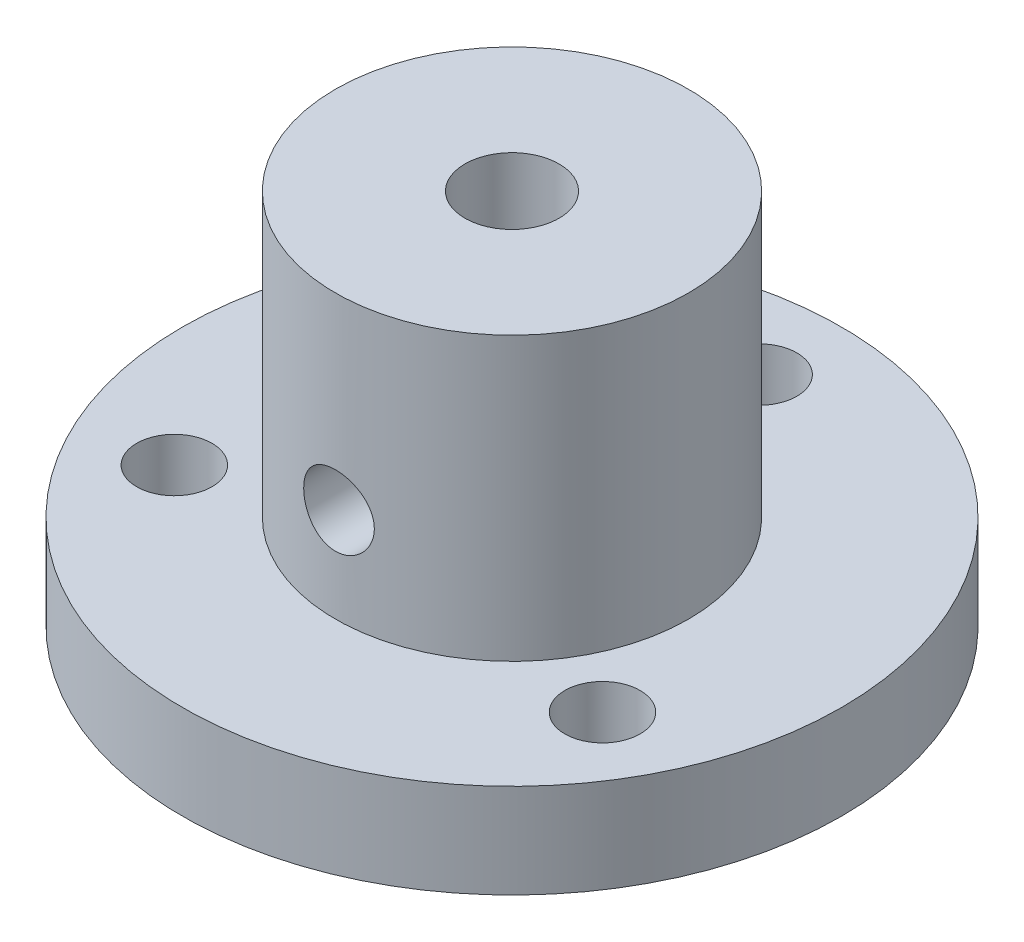
ISO-10303-21;
HEADER;
FILE_DESCRIPTION(('STEP AP214'),'2;1');
FILE_NAME('part.step','',(''),(''),'','','');
FILE_SCHEMA(('AUTOMOTIVE_DESIGN { 1 0 10303 214 1 1 1 1 }'));
ENDSEC;
DATA;
#1=APPLICATION_CONTEXT('core data for automotive mechanical design processes');
#2=APPLICATION_PROTOCOL_DEFINITION('international standard','automotive_design',2000,#1);
#3=PRODUCT_CONTEXT('',#1,'mechanical');
#4=PRODUCT('Part','Part','',(#3));
#5=PRODUCT_RELATED_PRODUCT_CATEGORY('part','',(#4));
#6=PRODUCT_DEFINITION_FORMATION('','',#4);
#7=PRODUCT_DEFINITION_CONTEXT('part definition',#1,'design');
#8=PRODUCT_DEFINITION('design','',#6,#7);
#9=PRODUCT_DEFINITION_SHAPE('','',#8);
#10=(LENGTH_UNIT() NAMED_UNIT(*) SI_UNIT(.MILLI.,.METRE.));
#11=(NAMED_UNIT(*) PLANE_ANGLE_UNIT() SI_UNIT($,.RADIAN.));
#12=(NAMED_UNIT(*) SI_UNIT($,.STERADIAN.) SOLID_ANGLE_UNIT());
#13=UNCERTAINTY_MEASURE_WITH_UNIT(LENGTH_MEASURE(1.E-05),#10,'distance_accuracy_value','');
#14=(GEOMETRIC_REPRESENTATION_CONTEXT(3) GLOBAL_UNCERTAINTY_ASSIGNED_CONTEXT((#13)) GLOBAL_UNIT_ASSIGNED_CONTEXT((#10,
#11,#12)) REPRESENTATION_CONTEXT('',''));
#15=CARTESIAN_POINT('',(0.,0.,0.));
#16=DIRECTION('',(0.,0.,1.));
#17=DIRECTION('',(1.,0.,0.));
#18=AXIS2_PLACEMENT_3D('',#15,#16,#17);
#19=CARTESIAN_POINT('',(0.,0.,0.));
#20=DIRECTION('',(0.,1.,0.));
#21=DIRECTION('',(-1.,0.,0.));
#22=AXIS2_PLACEMENT_3D('',#19,#20,#21);
#23=CYLINDRICAL_SURFACE('',#22,7.5);
#24=CARTESIAN_POINT('',(0.,16.,0.));
#25=DIRECTION('',(0.,1.,0.));
#26=DIRECTION('',(-1.,0.,0.));
#27=AXIS2_PLACEMENT_3D('',#24,#25,#26);
#28=CIRCLE('',#27,7.5);
#29=CARTESIAN_POINT('',(-7.5,16.,0.));
#30=VERTEX_POINT('',#29);
#31=EDGE_CURVE('E82',#30,#30,#28,.T.);
#32=ORIENTED_EDGE('',*,*,#31,.F.);
#33=EDGE_LOOP('',(#32));
#34=FACE_BOUND('',#33,.T.);
#35=CARTESIAN_POINT('',(0.,4.,0.));
#36=DIRECTION('',(0.,1.,0.));
#37=DIRECTION('',(-1.,0.,0.));
#38=AXIS2_PLACEMENT_3D('',#35,#36,#37);
#39=CIRCLE('',#38,7.5);
#40=CARTESIAN_POINT('',(-7.5,4.,0.));
#41=VERTEX_POINT('',#40);
#42=EDGE_CURVE('E56',#41,#41,#39,.T.);
#43=ORIENTED_EDGE('',*,*,#42,.T.);
#44=EDGE_LOOP('',(#43));
#45=FACE_BOUND('',#44,.T.);
#46=CARTESIAN_POINT('',(-1.5,8.,7.34846922834953));
#47=CARTESIAN_POINT('',(-1.49999691881235,8.08334656323576,7.34847088538349));
#48=CARTESIAN_POINT('',(-1.49302975757707,8.16673193499975,7.34990262402618));
#49=CARTESIAN_POINT('',(-1.46536842537441,8.33114375771496,7.35546646957747));
#50=CARTESIAN_POINT('',(-1.44466327060578,8.41216826695404,7.35960073717297));
#51=CARTESIAN_POINT('',(-1.39019367392958,8.56945595503125,7.37008310582665));
#52=CARTESIAN_POINT('',(-1.35644222122892,8.64572378229887,7.37642900431582));
#53=CARTESIAN_POINT('',(-1.27687366150577,8.79151226704545,7.39061699221019));
#54=CARTESIAN_POINT('',(-1.23105722790173,8.86103330080686,7.398458998102));
#55=CARTESIAN_POINT('',(-1.12796861348015,8.99234150578079,7.4148794954137));
#56=CARTESIAN_POINT('',(-1.07055848386998,9.05401938182596,7.42346606755867));
#57=CARTESIAN_POINT('',(-0.946210183531966,9.16693630036847,7.440337084539));
#58=CARTESIAN_POINT('',(-0.879271345466976,9.21817461112579,7.44862150816248));
#59=CARTESIAN_POINT('',(-0.737042033886383,9.30918202644269,7.46404194626342));
#60=CARTESIAN_POINT('',(-0.661683851508316,9.34884727072496,7.47116732162326));
#61=CARTESIAN_POINT('',(-0.505206225580908,9.4149124055722,7.48337605325447));
#62=CARTESIAN_POINT('',(-0.42408732213083,9.44131353785149,7.48845960066179));
#63=CARTESIAN_POINT('',(-0.259525159917742,9.47976079042944,7.49595481032627));
#64=CARTESIAN_POINT('',(-0.176126608822222,9.49199146635651,7.4984007943219));
#65=CARTESIAN_POINT('',(-0.00842785265630505,9.50232642775747,7.50046381775405));
#66=CARTESIAN_POINT('',(0.0758722647477642,9.50043207446873,7.50008112979138));
#67=CARTESIAN_POINT('',(0.241713001115382,9.48271072967667,7.49655652302773));
#68=CARTESIAN_POINT('',(0.323275821447705,9.46708253424823,7.49345397548757));
#69=CARTESIAN_POINT('',(0.482597439870451,9.42265245131166,7.48488265739113));
#70=CARTESIAN_POINT('',(0.560356085620693,9.39385003671219,7.47941379216058));
#71=CARTESIAN_POINT('',(0.71042919480133,9.3237049397791,7.46665944029938));
#72=CARTESIAN_POINT('',(0.782706261200849,9.28228437334267,7.45936272262835));
#73=CARTESIAN_POINT('',(0.919357568789633,9.1881363841451,7.44375704210678));
#74=CARTESIAN_POINT('',(0.9837308992875,9.13540766034423,7.43544796282833));
#75=CARTESIAN_POINT('',(1.10392714658019,9.01904956683729,7.41856446546689));
#76=CARTESIAN_POINT('',(1.15958147486045,8.95524621990562,7.40998794686274));
#77=CARTESIAN_POINT('',(1.25942773976521,8.81912533632387,7.39367357398141));
#78=CARTESIAN_POINT('',(1.30361945959163,8.74680763867521,7.38593573556822));
#79=CARTESIAN_POINT('',(1.37934422220282,8.59546875226729,7.37217071209385));
#80=CARTESIAN_POINT('',(1.41084997166656,8.51643354854051,7.36614722345324));
#81=CARTESIAN_POINT('',(1.46008551244137,8.35404301441401,7.35654714481909));
#82=CARTESIAN_POINT('',(1.47781709918496,8.27068824857137,7.35297023592641));
#83=CARTESIAN_POINT('',(1.49874900905408,8.10355271300143,7.34873218901741));
#84=CARTESIAN_POINT('',(1.50219278834687,8.01980363853449,7.34802220585731));
#85=CARTESIAN_POINT('',(1.49510644246611,7.85292766520047,7.34946728533281));
#86=CARTESIAN_POINT('',(1.48457710968366,7.7698007313217,7.35162218550582));
#87=CARTESIAN_POINT('',(1.45005331211124,7.60734703956165,7.35850848742372));
#88=CARTESIAN_POINT('',(1.42618893125895,7.52799148544635,7.36321498521745));
#89=CARTESIAN_POINT('',(1.36581155296278,7.37440508145689,7.37465234027497));
#90=CARTESIAN_POINT('',(1.32929751355976,7.30017465434642,7.38138336429404));
#91=CARTESIAN_POINT('',(1.2441062133234,7.15788033507476,7.39622108943059));
#92=CARTESIAN_POINT('',(1.19527661697413,7.08990943054876,7.40434457797355));
#93=CARTESIAN_POINT('',(1.08704335831907,6.96303753199863,7.42100585739955));
#94=CARTESIAN_POINT('',(1.02763860771681,6.90413747262612,7.42954369085727));
#95=CARTESIAN_POINT('',(0.898848410246835,6.79615616122163,7.44623018803823));
#96=CARTESIAN_POINT('',(0.829323748394444,6.74723951802501,7.45437086563026));
#97=CARTESIAN_POINT('',(0.682901844952132,6.66178117775062,7.4692069144293));
#98=CARTESIAN_POINT('',(0.606004913150259,6.62523896098283,7.47590234632816));
#99=CARTESIAN_POINT('',(0.447454021236018,6.56580669238005,7.487059410916));
#100=CARTESIAN_POINT('',(0.365830010217116,6.54283922266062,7.49153368713906));
#101=CARTESIAN_POINT('',(0.199784182019868,6.51096312850423,7.4977985390649));
#102=CARTESIAN_POINT('',(0.115362703066821,6.50205281078648,7.49958943799765));
#103=CARTESIAN_POINT('',(-0.0523093408554355,6.49860952855567,7.50027810681181));
#104=CARTESIAN_POINT('',(-0.135554718212254,6.50382907931568,7.49922567824026));
#105=CARTESIAN_POINT('',(-0.299956546973463,6.52795092582172,7.49445065340477));
#106=CARTESIAN_POINT('',(-0.381113024630537,6.54685304952211,7.49072809071528));
#107=CARTESIAN_POINT('',(-0.538879124617644,6.59769348813747,7.481032475475));
#108=CARTESIAN_POINT('',(-0.615498664860421,6.62960206719678,7.47506455871865));
#109=CARTESIAN_POINT('',(-0.762331830278929,6.70551836199635,7.46152083185077));
#110=CARTESIAN_POINT('',(-0.832544948651118,6.74952703385557,7.45394489468828));
#111=CARTESIAN_POINT('',(-0.965795835159536,6.84922908059312,7.43786398736791));
#112=CARTESIAN_POINT('',(-1.02869957417475,6.90509950458016,7.4293460013317));
#113=CARTESIAN_POINT('',(-1.14432392663527,7.02657536014365,7.41241834355477));
#114=CARTESIAN_POINT('',(-1.19704212480408,7.09218309420307,7.40400869794476));
#115=CARTESIAN_POINT('',(-1.29133832918279,7.23211897505031,7.3881501412478));
#116=CARTESIAN_POINT('',(-1.33279022195961,7.30653344174069,7.38071255446371));
#117=CARTESIAN_POINT('',(-1.40253607393175,7.4613991599494,7.36777855777287));
#118=CARTESIAN_POINT('',(-1.43084196896908,7.54184485804634,7.36228038807748));
#119=CARTESIAN_POINT('',(-1.4680037097813,7.68539368315525,7.3549452169166));
#120=CARTESIAN_POINT('',(-1.47998084778413,7.74767812926849,7.35253177367824));
#121=CARTESIAN_POINT('',(-1.49598002694097,7.87330093182915,7.34929317692711));
#122=CARTESIAN_POINT('',(-1.50000234234439,7.93663925186744,7.34846796865858));
#123=CARTESIAN_POINT('',(-1.5,8.,7.34846922834953));
#124=B_SPLINE_CURVE_WITH_KNOTS('',3,(#46,#47,#48,#49,#50,#51,#52,#53,#54,#55,#56,#57,#58,#59,
#60,#61,#62,#63,#64,#65,#66,#67,#68,#69,#70,#71,#72,#73,#74,#75,#76,#77,#78,#79,#80,#81,#82,#83,
#84,#85,#86,#87,#88,#89,#90,#91,#92,#93,#94,#95,#96,#97,#98,#99,#100,#101,#102,#103,#104,#105,
#106,#107,#108,#109,#110,#111,#112,#113,#114,#115,#116,#117,#118,#119,#120,#121,#122,#123),
.UNSPECIFIED.,.T.,.F.,(4,2,2,2,2,2,2,2,2,2,2,2,2,2,2,2,2,2,2,2,2,2,2,2,2,2,2,2,2,2,2,2,2,2,2,2,
2,2,4),(0.,0.249807695804143,0.499815358926445,0.74957474691088,0.999320197289796,
1.25223378822655,1.50516510053133,1.76030100656175,2.0154130236984,2.26716373324621,
2.51889018174372,2.76703184450306,3.01518343610625,3.26489886333455,3.51464303655099,
3.76874020143725,4.02284217184081,4.27748794759165,4.53210052524037,4.78235636706891,
5.03259801792632,5.28044012674978,5.52830265531598,5.77939589661781,6.03051499305313,
6.28548902600176,6.54045234945157,6.79394720367975,7.04741152037442,7.29646526122029,
7.54551587050135,7.79400025613177,8.04250428202026,8.29501728038395,8.54759008334671,
8.80288347868562,9.05794462633399,9.24785705455344,9.43776293526322),.UNSPECIFIED.);
#125=CARTESIAN_POINT('',(-1.5,8.,7.34846922834953));
#126=VERTEX_POINT('',#125);
#127=EDGE_CURVE('E123',#126,#126,#124,.T.);
#128=ORIENTED_EDGE('',*,*,#127,.T.);
#129=EDGE_LOOP('',(#128));
#130=FACE_BOUND('',#129,.T.);
#131=ADVANCED_FACE('F36',(#34,#45,#130),#23,.T.);
#132=CARTESIAN_POINT('',(0.,0.,0.));
#133=DIRECTION('',(0.,1.,0.));
#134=DIRECTION('',(-1.,0.,0.));
#135=AXIS2_PLACEMENT_3D('',#132,#133,#134);
#136=CYLINDRICAL_SURFACE('',#135,2.);
#137=CARTESIAN_POINT('',(0.,0.,0.));
#138=DIRECTION('',(0.,1.,0.));
#139=DIRECTION('',(-1.,0.,0.));
#140=AXIS2_PLACEMENT_3D('',#137,#138,#139);
#141=CIRCLE('',#140,2.);
#142=CARTESIAN_POINT('',(-2.,0.,0.));
#143=VERTEX_POINT('',#142);
#144=EDGE_CURVE('E71',#143,#143,#141,.T.);
#145=ORIENTED_EDGE('',*,*,#144,.F.);
#146=EDGE_LOOP('',(#145));
#147=FACE_BOUND('',#146,.T.);
#148=CARTESIAN_POINT('',(0.,16.,0.));
#149=DIRECTION('',(0.,1.,0.));
#150=DIRECTION('',(-1.,0.,0.));
#151=AXIS2_PLACEMENT_3D('',#148,#149,#150);
#152=CIRCLE('',#151,2.);
#153=CARTESIAN_POINT('',(-2.,16.,0.));
#154=VERTEX_POINT('',#153);
#155=EDGE_CURVE('E76',#154,#154,#152,.T.);
#156=ORIENTED_EDGE('',*,*,#155,.T.);
#157=EDGE_LOOP('',(#156));
#158=FACE_BOUND('',#157,.T.);
#159=CARTESIAN_POINT('',(-1.5,8.,1.3228756555323));
#160=CARTESIAN_POINT('',(-1.49999219049447,7.93000257657437,1.32289190044095));
#161=CARTESIAN_POINT('',(-1.4950410907442,7.85995416568808,1.32856366615417));
#162=CARTESIAN_POINT('',(-1.47578333210409,7.72267014379052,1.34990644032802));
#163=CARTESIAN_POINT('',(-1.46144878565587,7.65544355498049,1.3656072516867));
#164=CARTESIAN_POINT('',(-1.42483838991846,7.52642015326162,1.40375127916871));
#165=CARTESIAN_POINT('',(-1.40267483444956,7.46456122323754,1.42609848244814));
#166=CARTESIAN_POINT('',(-1.35130655299363,7.34565454555481,1.47486455031267));
#167=CARTESIAN_POINT('',(-1.3221026780169,7.28860621753078,1.50128292264932));
#168=CARTESIAN_POINT('',(-1.25039909811054,7.16788720368341,1.56177312961147));
#169=CARTESIAN_POINT('',(-1.20639573950363,7.10533206577352,1.59628904009787));
#170=CARTESIAN_POINT('',(-1.10933596759308,6.98747453375773,1.66521164096378));
#171=CARTESIAN_POINT('',(-1.05626622282799,6.93218303517973,1.69961809339876));
#172=CARTESIAN_POINT('',(-0.929610192252514,6.81914126134453,1.77262582436251));
#173=CARTESIAN_POINT('',(-0.854047289142163,6.76319403328014,1.81064921229759));
#174=CARTESIAN_POINT('',(-0.69118971482194,6.66537779171716,1.87882809751632));
#175=CARTESIAN_POINT('',(-0.603923293836167,6.62347570253119,1.90900204180106));
#176=CARTESIAN_POINT('',(-0.447869023983645,6.56679231409706,1.95034258990248));
#177=CARTESIAN_POINT('',(-0.381446049692536,6.54764290402153,1.96449710921006));
#178=CARTESIAN_POINT('',(-0.245552609316542,6.51860988400325,1.98605635937555));
#179=CARTESIAN_POINT('',(-0.17608484599517,6.50871822389326,1.99346695432364));
#180=CARTESIAN_POINT('',(-0.0358650926220279,6.49877826613751,2.00091375578087));
#181=CARTESIAN_POINT('',(0.0348897591186388,6.49875554562356,2.00093080057495));
#182=CARTESIAN_POINT('',(0.175316156674036,6.50861793678029,1.99354206503066));
#183=CARTESIAN_POINT('',(0.244987447822227,6.51850534290814,1.98613456571337));
#184=CARTESIAN_POINT('',(0.378889193792651,6.54708105058987,1.96491377944411));
#185=CARTESIAN_POINT('',(0.443224268236295,6.56545632638707,1.9513285776568));
#186=CARTESIAN_POINT('',(0.567680485046396,6.60999564218224,1.91882278657017));
#187=CARTESIAN_POINT('',(0.627800705033635,6.63616138051316,1.89990103394193));
#188=CARTESIAN_POINT('',(0.749216921864729,6.69852961514531,1.85561045984504));
#189=CARTESIAN_POINT('',(0.809935384713597,6.73551209661876,1.82976540608097));
#190=CARTESIAN_POINT('',(0.924567250548283,6.81673370397051,1.77460702483739));
#191=CARTESIAN_POINT('',(0.97847478462122,6.8609790136999,1.74529074780453));
#192=CARTESIAN_POINT('',(1.08908204283329,6.96522334882094,1.6789376587236));
#193=CARTESIAN_POINT('',(1.14424493004784,7.0266092100264,1.64151655866368));
#194=CARTESIAN_POINT('',(1.24400875556228,7.15783458362194,1.56725958283769));
#195=CARTESIAN_POINT('',(1.28860466211477,7.22767809952506,1.53042399363523));
#196=CARTESIAN_POINT('',(1.358732064116,7.36098187024563,1.46819425999159));
#197=CARTESIAN_POINT('',(1.38628866868102,7.42298704530065,1.44197599789983));
#198=CARTESIAN_POINT('',(1.43319397108784,7.55206528141938,1.39536741257394));
#199=CARTESIAN_POINT('',(1.45256121808259,7.61912647969037,1.37496395320511));
#200=CARTESIAN_POINT('',(1.47902385350669,7.74368694399832,1.34640050620232));
#201=CARTESIAN_POINT('',(1.48779069496582,7.80044708211686,1.3366153955687));
#202=CARTESIAN_POINT('',(1.49871760619789,7.91535546617383,1.32435588438334));
#203=CARTESIAN_POINT('',(1.50088612873265,7.97350183990282,1.32187213058307));
#204=CARTESIAN_POINT('',(1.49845270115552,8.08947899173339,1.32462868790497));
#205=CARTESIAN_POINT('',(1.4938482589949,8.14730964580967,1.32987184207164));
#206=CARTESIAN_POINT('',(1.47822527271969,8.26107615244287,1.34721218775046));
#207=CARTESIAN_POINT('',(1.46719578056394,8.3170085979481,1.35932107727345));
#208=CARTESIAN_POINT('',(1.43413959562387,8.44633804493887,1.39427758287802));
#209=CARTESIAN_POINT('',(1.40954189769242,8.51843595391503,1.41944823697315));
#210=CARTESIAN_POINT('',(1.35088877838435,8.65630766364011,1.47537861079975));
#211=CARTESIAN_POINT('',(1.31681594335477,8.72206951729474,1.5061485847723));
#212=CARTESIAN_POINT('',(1.23869774116696,8.84934900804812,1.57108282375649));
#213=CARTESIAN_POINT('',(1.19434110060342,8.91063287621825,1.60532883846045));
#214=CARTESIAN_POINT('',(1.09682562914593,9.02600209636124,1.67347506272361));
#215=CARTESIAN_POINT('',(1.04366252194464,9.08008392798893,1.70737509574665));
#216=CARTESIAN_POINT('',(0.916234513829626,9.19127699162936,1.77960222623532));
#217=CARTESIAN_POINT('',(0.839896270946862,9.24647523885759,1.81728174165356));
#218=CARTESIAN_POINT('',(0.675551612651274,9.34262073345087,1.88453104769825));
#219=CARTESIAN_POINT('',(0.587571029974858,9.38359882458129,1.91411836052283));
#220=CARTESIAN_POINT('',(0.430755661496918,9.43843799144686,1.95419406402379));
#221=CARTESIAN_POINT('',(0.364250057327479,9.45675679327544,1.96775478029639));
#222=CARTESIAN_POINT('',(0.228364464964359,9.48412879630752,1.98810265589123));
#223=CARTESIAN_POINT('',(0.15898710456195,9.49319028154851,1.9948958710696));
#224=CARTESIAN_POINT('',(0.019147605940406,9.5015163909286,2.00113566717062));
#225=CARTESIAN_POINT('',(-0.0513166925870804,9.50075801734825,2.00056500218907));
#226=CARTESIAN_POINT('',(-0.191009011030074,9.48943900869876,1.9920880324381));
#227=CARTESIAN_POINT('',(-0.260236696591282,9.47887576229252,1.98417977344351));
#228=CARTESIAN_POINT('',(-0.393521935254966,9.44902508383276,1.96203400925195));
#229=CARTESIAN_POINT('',(-0.457671236511436,9.42999981867845,1.94798690792879));
#230=CARTESIAN_POINT('',(-0.581661343097383,9.38421193438106,1.91462720575136));
#231=CARTESIAN_POINT('',(-0.641501223388809,9.35744766016909,1.89531347862387));
#232=CARTESIAN_POINT('',(-0.762547698766807,9.29372206240404,1.85017642210641));
#233=CARTESIAN_POINT('',(-0.823141236713413,9.25594906864042,1.82386352707581));
#234=CARTESIAN_POINT('',(-0.937414811724209,9.17313355944579,1.76785506075717));
#235=CARTESIAN_POINT('',(-0.991088412383368,9.12808436271396,1.73815638795658));
#236=CARTESIAN_POINT('',(-1.10112380660681,9.02199463343921,1.67106353042107));
#237=CARTESIAN_POINT('',(-1.15591691541995,8.9595536005601,1.63330922504698));
#238=CARTESIAN_POINT('',(-1.2547525342935,8.82613192810013,1.55866082463333));
#239=CARTESIAN_POINT('',(-1.29879110556728,8.75514817396344,1.52176704921892));
#240=CARTESIAN_POINT('',(-1.36695971301454,8.6211167494097,1.46049601449285));
#241=CARTESIAN_POINT('',(-1.39333526337998,8.55966501729345,1.43513625007637));
#242=CARTESIAN_POINT('',(-1.43805398028599,8.43191708694413,1.39032564651233));
#243=CARTESIAN_POINT('',(-1.45641847678344,8.36563430840455,1.37085915899696));
#244=CARTESIAN_POINT('',(-1.4799705775638,8.24921178040307,1.34532423383262));
#245=CARTESIAN_POINT('',(-1.48744249026866,8.20003292870954,1.3370013026568));
#246=CARTESIAN_POINT('',(-1.49745839072448,8.10057766696635,1.32577295392455));
#247=CARTESIAN_POINT('',(-1.50000561211714,8.05030199905628,1.32286398151146));
#248=CARTESIAN_POINT('',(-1.5,8.,1.3228756555323));
#249=B_SPLINE_CURVE_WITH_KNOTS('',3,(#159,#160,#161,#162,#163,#164,#165,#166,#167,#168,#169,
#170,#171,#172,#173,#174,#175,#176,#177,#178,#179,#180,#181,#182,#183,#184,#185,#186,#187,#188,
#189,#190,#191,#192,#193,#194,#195,#196,#197,#198,#199,#200,#201,#202,#203,#204,#205,#206,#207,
#208,#209,#210,#211,#212,#213,#214,#215,#216,#217,#218,#219,#220,#221,#222,#223,#224,#225,#226,
#227,#228,#229,#230,#231,#232,#233,#234,#235,#236,#237,#238,#239,#240,#241,#242,#243,#244,#245,
#246,#247,#248),.UNSPECIFIED.,.T.,.F.,(4,2,2,2,2,2,2,2,2,2,2,2,2,2,2,2,2,2,2,2,2,2,2,2,2,2,2,2,
2,2,2,2,2,2,2,2,2,2,2,2,2,2,2,2,4),(0.,0.20973177668449,0.420089722582994,0.62754538562014,
0.834975984672344,1.08585208691169,1.33710031031849,1.63964848103538,1.94147907444963,
2.15227725277555,2.36289195870711,2.57405250727807,2.78526195641288,2.9892375589505,
3.19325766108669,3.41936844116895,3.64567274887663,3.91649517204702,4.18744629647933,
4.40499409477196,4.62204646613006,4.79608005545901,4.96989060538192,5.14376512326212,
5.31793678696019,5.55730028202397,5.7971066263915,6.04543209090059,6.29387849446617,
6.59652499511462,6.89851088586564,7.10852896194426,7.3183589353918,7.52868041101043,
7.73905791773944,7.94332812691911,8.14764205379332,8.37510052489609,8.60276905744643,
8.87547580578154,9.1482822820853,9.36218279640834,9.57551025772698,9.72632812073766,
9.87704692032409),.UNSPECIFIED.);
#250=CARTESIAN_POINT('',(-1.5,8.,1.3228756555323));
#251=VERTEX_POINT('',#250);
#252=EDGE_CURVE('E40',#251,#251,#249,.T.);
#253=ORIENTED_EDGE('',*,*,#252,.T.);
#254=EDGE_LOOP('',(#253));
#255=FACE_BOUND('',#254,.T.);
#256=ADVANCED_FACE('F113',(#147,#158,#255),#136,.F.);
#257=CARTESIAN_POINT('',(-2.,0.,0.));
#258=DIRECTION('',(0.,-1.,0.));
#259=DIRECTION('',(1.,0.,0.));
#260=AXIS2_PLACEMENT_3D('',#257,#258,#259);
#261=PLANE('',#260);
#262=CARTESIAN_POINT('',(0.,0.,-10.5));
#263=DIRECTION('',(0.,1.,0.));
#264=DIRECTION('',(0.,0.,1.));
#265=AXIS2_PLACEMENT_3D('',#262,#263,#264);
#266=CIRCLE('',#265,1.6);
#267=CARTESIAN_POINT('',(0.,0.,-8.9));
#268=VERTEX_POINT('',#267);
#269=EDGE_CURVE('E65',#268,#268,#266,.T.);
#270=ORIENTED_EDGE('',*,*,#269,.T.);
#271=EDGE_LOOP('',(#270));
#272=FACE_BOUND('',#271,.T.);
#273=CARTESIAN_POINT('',(9.09326673973661,0.,5.25));
#274=DIRECTION('',(0.,1.,0.));
#275=DIRECTION('',(0.,0.,1.));
#276=AXIS2_PLACEMENT_3D('',#273,#274,#275);
#277=CIRCLE('',#276,1.60000000000005);
#278=CARTESIAN_POINT('',(9.09326673973661,0.,6.85000000000005));
#279=VERTEX_POINT('',#278);
#280=EDGE_CURVE('E155',#279,#279,#277,.T.);
#281=ORIENTED_EDGE('',*,*,#280,.T.);
#282=EDGE_LOOP('',(#281));
#283=FACE_BOUND('',#282,.T.);
#284=CARTESIAN_POINT('',(-9.09326673973661,0.,5.25));
#285=DIRECTION('',(0.,1.,0.));
#286=DIRECTION('',(0.,0.,1.));
#287=AXIS2_PLACEMENT_3D('',#284,#285,#286);
#288=CIRCLE('',#287,1.60000000000009);
#289=CARTESIAN_POINT('',(-9.09326673973661,0.,6.85000000000009));
#290=VERTEX_POINT('',#289);
#291=EDGE_CURVE('E85',#290,#290,#288,.T.);
#292=ORIENTED_EDGE('',*,*,#291,.T.);
#293=EDGE_LOOP('',(#292));
#294=FACE_BOUND('',#293,.T.);
#295=ORIENTED_EDGE('',*,*,#144,.T.);
#296=EDGE_LOOP('',(#295));
#297=FACE_BOUND('',#296,.T.);
#298=CARTESIAN_POINT('',(0.,0.,0.));
#299=DIRECTION('',(0.,1.,0.));
#300=DIRECTION('',(-1.,0.,0.));
#301=AXIS2_PLACEMENT_3D('',#298,#299,#300);
#302=CIRCLE('',#301,14.);
#303=CARTESIAN_POINT('',(-14.,0.,0.));
#304=VERTEX_POINT('',#303);
#305=EDGE_CURVE('E10',#304,#304,#302,.T.);
#306=ORIENTED_EDGE('',*,*,#305,.F.);
#307=EDGE_LOOP('',(#306));
#308=FACE_BOUND('',#307,.T.);
#309=ADVANCED_FACE('F38',(#272,#283,#294,#297,#308),#261,.T.);
#310=CARTESIAN_POINT('',(0.,0.,0.));
#311=DIRECTION('',(0.,1.,0.));
#312=DIRECTION('',(-1.,0.,0.));
#313=AXIS2_PLACEMENT_3D('',#310,#311,#312);
#314=CYLINDRICAL_SURFACE('',#313,14.);
#315=ORIENTED_EDGE('',*,*,#305,.T.);
#316=EDGE_LOOP('',(#315));
#317=FACE_BOUND('',#316,.T.);
#318=CARTESIAN_POINT('',(0.,4.,0.));
#319=DIRECTION('',(0.,1.,0.));
#320=DIRECTION('',(-1.,0.,0.));
#321=AXIS2_PLACEMENT_3D('',#318,#319,#320);
#322=CIRCLE('',#321,14.);
#323=CARTESIAN_POINT('',(-14.,4.,0.));
#324=VERTEX_POINT('',#323);
#325=EDGE_CURVE('E50',#324,#324,#322,.T.);
#326=ORIENTED_EDGE('',*,*,#325,.F.);
#327=EDGE_LOOP('',(#326));
#328=FACE_BOUND('',#327,.T.);
#329=ADVANCED_FACE('F99',(#317,#328),#314,.T.);
#330=CARTESIAN_POINT('',(-14.,4.,0.));
#331=DIRECTION('',(0.,1.,0.));
#332=DIRECTION('',(-1.,0.,0.));
#333=AXIS2_PLACEMENT_3D('',#330,#331,#332);
#334=PLANE('',#333);
#335=CARTESIAN_POINT('',(0.,4.,-10.5));
#336=DIRECTION('',(0.,1.,0.));
#337=DIRECTION('',(-1.,0.,0.));
#338=AXIS2_PLACEMENT_3D('',#335,#336,#337);
#339=CIRCLE('',#338,1.6);
#340=CARTESIAN_POINT('',(-1.6,4.,-10.5));
#341=VERTEX_POINT('',#340);
#342=EDGE_CURVE('E68',#341,#341,#339,.F.);
#343=ORIENTED_EDGE('',*,*,#342,.T.);
#344=EDGE_LOOP('',(#343));
#345=FACE_BOUND('',#344,.T.);
#346=CARTESIAN_POINT('',(9.09326673973661,4.,5.25));
#347=DIRECTION('',(0.,1.,0.));
#348=DIRECTION('',(-1.,0.,0.));
#349=AXIS2_PLACEMENT_3D('',#346,#347,#348);
#350=CIRCLE('',#349,1.60000000000005);
#351=CARTESIAN_POINT('',(7.49326673973656,4.,5.25));
#352=VERTEX_POINT('',#351);
#353=EDGE_CURVE('E64',#352,#352,#350,.F.);
#354=ORIENTED_EDGE('',*,*,#353,.T.);
#355=EDGE_LOOP('',(#354));
#356=FACE_BOUND('',#355,.T.);
#357=CARTESIAN_POINT('',(-9.09326673973661,4.,5.25));
#358=DIRECTION('',(0.,1.,0.));
#359=DIRECTION('',(-1.,0.,0.));
#360=AXIS2_PLACEMENT_3D('',#357,#358,#359);
#361=CIRCLE('',#360,1.60000000000009);
#362=CARTESIAN_POINT('',(-10.6932667397367,4.,5.25));
#363=VERTEX_POINT('',#362);
#364=EDGE_CURVE('E60',#363,#363,#361,.F.);
#365=ORIENTED_EDGE('',*,*,#364,.T.);
#366=EDGE_LOOP('',(#365));
#367=FACE_BOUND('',#366,.T.);
#368=ORIENTED_EDGE('',*,*,#325,.T.);
#369=EDGE_LOOP('',(#368));
#370=FACE_BOUND('',#369,.T.);
#371=ORIENTED_EDGE('',*,*,#42,.F.);
#372=EDGE_LOOP('',(#371));
#373=FACE_BOUND('',#372,.T.);
#374=ADVANCED_FACE('F96',(#345,#356,#367,#370,#373),#334,.T.);
#375=CARTESIAN_POINT('',(-7.5,16.,0.));
#376=DIRECTION('',(0.,1.,0.));
#377=DIRECTION('',(-1.,0.,0.));
#378=AXIS2_PLACEMENT_3D('',#375,#376,#377);
#379=PLANE('',#378);
#380=ORIENTED_EDGE('',*,*,#31,.T.);
#381=EDGE_LOOP('',(#380));
#382=FACE_BOUND('',#381,.T.);
#383=ORIENTED_EDGE('',*,*,#155,.F.);
#384=EDGE_LOOP('',(#383));
#385=FACE_BOUND('',#384,.T.);
#386=ADVANCED_FACE('F98',(#382,#385),#379,.T.);
#387=CARTESIAN_POINT('',(-9.09326673973661,16.,5.25));
#388=DIRECTION('',(0.,-1.,0.));
#389=DIRECTION('',(0.,0.,-1.));
#390=AXIS2_PLACEMENT_3D('',#387,#388,#389);
#391=CYLINDRICAL_SURFACE('',#390,1.60000000000009);
#392=ORIENTED_EDGE('',*,*,#364,.F.);
#393=EDGE_LOOP('',(#392));
#394=FACE_BOUND('',#393,.T.);
#395=ORIENTED_EDGE('',*,*,#291,.F.);
#396=EDGE_LOOP('',(#395));
#397=FACE_BOUND('',#396,.T.);
#398=ADVANCED_FACE('F106',(#394,#397),#391,.F.);
#399=CARTESIAN_POINT('',(9.09326673973661,16.,5.25));
#400=DIRECTION('',(0.,-1.,0.));
#401=DIRECTION('',(0.,0.,-1.));
#402=AXIS2_PLACEMENT_3D('',#399,#400,#401);
#403=CYLINDRICAL_SURFACE('',#402,1.60000000000005);
#404=ORIENTED_EDGE('',*,*,#353,.F.);
#405=EDGE_LOOP('',(#404));
#406=FACE_BOUND('',#405,.T.);
#407=ORIENTED_EDGE('',*,*,#280,.F.);
#408=EDGE_LOOP('',(#407));
#409=FACE_BOUND('',#408,.T.);
#410=ADVANCED_FACE('F139',(#406,#409),#403,.F.);
#411=CARTESIAN_POINT('',(0.,16.,-10.5));
#412=DIRECTION('',(0.,-1.,0.));
#413=DIRECTION('',(0.,0.,-1.));
#414=AXIS2_PLACEMENT_3D('',#411,#412,#413);
#415=CYLINDRICAL_SURFACE('',#414,1.6);
#416=ORIENTED_EDGE('',*,*,#342,.F.);
#417=EDGE_LOOP('',(#416));
#418=FACE_BOUND('',#417,.T.);
#419=ORIENTED_EDGE('',*,*,#269,.F.);
#420=EDGE_LOOP('',(#419));
#421=FACE_BOUND('',#420,.T.);
#422=ADVANCED_FACE('F134',(#418,#421),#415,.F.);
#423=CARTESIAN_POINT('',(0.,8.,14.));
#424=DIRECTION('',(0.,0.,-1.));
#425=DIRECTION('',(-1.,0.,0.));
#426=AXIS2_PLACEMENT_3D('',#423,#424,#425);
#427=CYLINDRICAL_SURFACE('',#426,1.5);
#428=ORIENTED_EDGE('',*,*,#127,.F.);
#429=EDGE_LOOP('',(#428));
#430=FACE_BOUND('',#429,.T.);
#431=ORIENTED_EDGE('',*,*,#252,.F.);
#432=EDGE_LOOP('',(#431));
#433=FACE_BOUND('',#432,.T.);
#434=ADVANCED_FACE('F130',(#430,#433),#427,.F.);
#435=CLOSED_SHELL('',(#131,#256,#309,#329,#374,#386,#398,#410,#422,#434));
#436=MANIFOLD_SOLID_BREP('B2',#435);
#437=ADVANCED_BREP_SHAPE_REPRESENTATION('',(#18,#436),#14);
#438=SHAPE_DEFINITION_REPRESENTATION(#9,#437);
ENDSEC;
END-ISO-10303-21;
